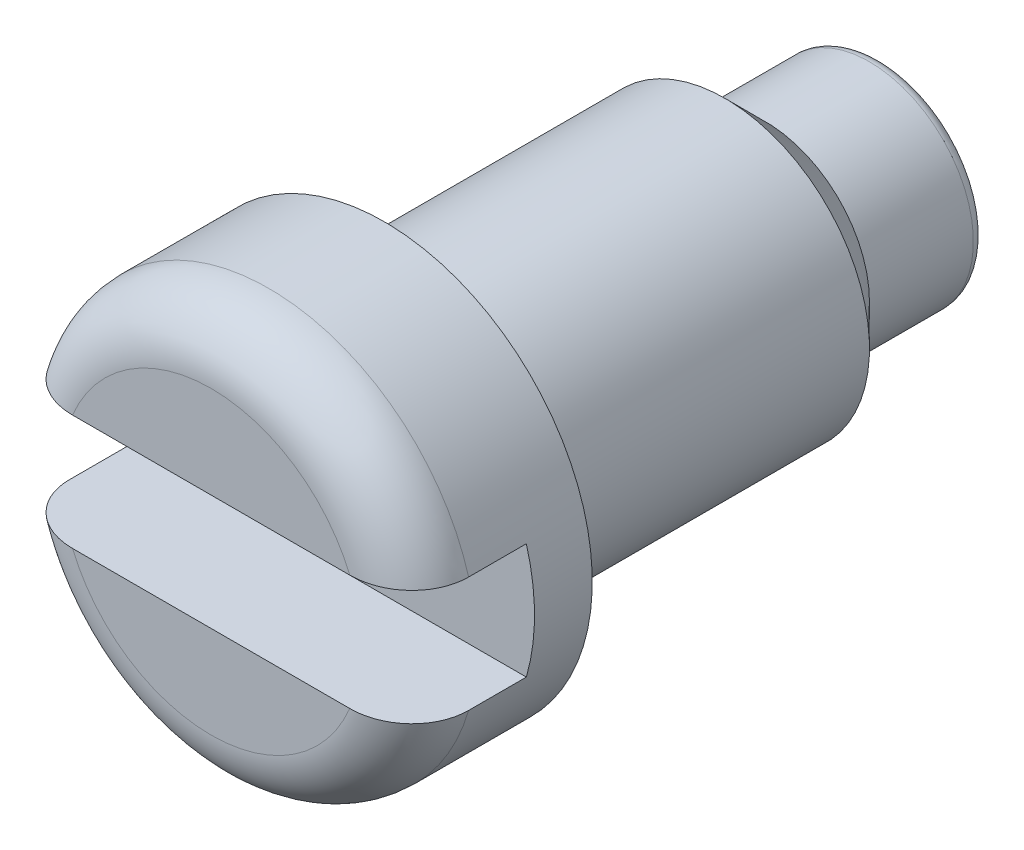
ISO-10303-21;
HEADER;
FILE_DESCRIPTION(('STEP AP214'),'2;1');
FILE_NAME('part.step','',(''),(''),'','','');
FILE_SCHEMA(('AUTOMOTIVE_DESIGN { 1 0 10303 214 1 1 1 1 }'));
ENDSEC;
DATA;
#1=APPLICATION_CONTEXT('core data for automotive mechanical design processes');
#2=APPLICATION_PROTOCOL_DEFINITION('international standard','automotive_design',2000,#1);
#3=PRODUCT_CONTEXT('',#1,'mechanical');
#4=PRODUCT('Part','Part','',(#3));
#5=PRODUCT_RELATED_PRODUCT_CATEGORY('part','',(#4));
#6=PRODUCT_DEFINITION_FORMATION('','',#4);
#7=PRODUCT_DEFINITION_CONTEXT('part definition',#1,'design');
#8=PRODUCT_DEFINITION('design','',#6,#7);
#9=PRODUCT_DEFINITION_SHAPE('','',#8);
#10=(LENGTH_UNIT() NAMED_UNIT(*) SI_UNIT(.MILLI.,.METRE.));
#11=(NAMED_UNIT(*) PLANE_ANGLE_UNIT() SI_UNIT($,.RADIAN.));
#12=(NAMED_UNIT(*) SI_UNIT($,.STERADIAN.) SOLID_ANGLE_UNIT());
#13=UNCERTAINTY_MEASURE_WITH_UNIT(LENGTH_MEASURE(1.E-05),#10,'distance_accuracy_value','');
#14=(GEOMETRIC_REPRESENTATION_CONTEXT(3) GLOBAL_UNCERTAINTY_ASSIGNED_CONTEXT((#13)) GLOBAL_UNIT_ASSIGNED_CONTEXT((#10,
#11,#12)) REPRESENTATION_CONTEXT('',''));
#15=CARTESIAN_POINT('',(0.,0.,0.));
#16=DIRECTION('',(0.,0.,1.));
#17=DIRECTION('',(1.,0.,0.));
#18=AXIS2_PLACEMENT_3D('',#15,#16,#17);
#19=CARTESIAN_POINT('',(1.8,0.5,4.80000000010954));
#20=DIRECTION('',(0.,0.,-1.));
#21=DIRECTION('',(-1.,0.,0.));
#22=AXIS2_PLACEMENT_3D('',#19,#20,#21);
#23=PLANE('',#22);
#24=CARTESIAN_POINT('',(0.,0.,4.80000000010954));
#25=DIRECTION('',(0.,0.,-1.));
#26=DIRECTION('',(-1.,0.,0.));
#27=AXIS2_PLACEMENT_3D('',#24,#25,#26);
#28=CIRCLE('',#27,1.8);
#29=CARTESIAN_POINT('',(-1.72916164657906,-0.5,4.80000000010954));
#30=VERTEX_POINT('',#29);
#31=CARTESIAN_POINT('',(-1.72916164657906,0.5,4.80000000010954));
#32=VERTEX_POINT('',#31);
#33=EDGE_CURVE('E81',#30,#32,#28,.T.);
#34=ORIENTED_EDGE('',*,*,#33,.F.);
#35=DIRECTION('',(1.,0.,0.));
#36=VECTOR('',#35,1.);
#37=CARTESIAN_POINT('',(1.8,-0.5,4.80000000010954));
#38=LINE('',#37,#36);
#39=CARTESIAN_POINT('',(1.72916164657906,-0.5,4.80000000010954));
#40=VERTEX_POINT('',#39);
#41=EDGE_CURVE('E79',#30,#40,#38,.T.);
#42=ORIENTED_EDGE('',*,*,#41,.T.);
#43=CARTESIAN_POINT('',(0.,0.,4.80000000010954));
#44=DIRECTION('',(0.,0.,-1.));
#45=DIRECTION('',(-1.,0.,0.));
#46=AXIS2_PLACEMENT_3D('',#43,#44,#45);
#47=CIRCLE('',#46,1.8);
#48=CARTESIAN_POINT('',(1.72916164657906,0.5,4.80000000010954));
#49=VERTEX_POINT('',#48);
#50=EDGE_CURVE('E19',#49,#40,#47,.T.);
#51=ORIENTED_EDGE('',*,*,#50,.F.);
#52=DIRECTION('',(1.,0.,0.));
#53=VECTOR('',#52,1.);
#54=CARTESIAN_POINT('',(1.8,0.5,4.80000000010954));
#55=LINE('',#54,#53);
#56=EDGE_CURVE('E73',#49,#32,#55,.F.);
#57=ORIENTED_EDGE('',*,*,#56,.T.);
#58=EDGE_LOOP('',(#34,#42,#51,#57));
#59=FACE_BOUND('',#58,.T.);
#60=ADVANCED_FACE('F16',(#59),#23,.F.);
#61=CARTESIAN_POINT('',(1.8,-0.5,4.80000000010954));
#62=DIRECTION('',(0.,-1.,0.));
#63=DIRECTION('',(0.,0.,-1.));
#64=AXIS2_PLACEMENT_3D('',#61,#62,#63);
#65=PLANE('',#64);
#66=ORIENTED_EDGE('',*,*,#41,.F.);
#67=DIRECTION('',(0.,0.,-1.));
#68=VECTOR('',#67,1.);
#69=CARTESIAN_POINT('',(-1.72916164657906,-0.5,4.80000000010954));
#70=LINE('',#69,#68);
#71=CARTESIAN_POINT('',(-1.72916164657906,-0.499999999999969,5.3));
#72=VERTEX_POINT('',#71);
#73=EDGE_CURVE('E90',#72,#30,#70,.T.);
#74=ORIENTED_EDGE('',*,*,#73,.F.);
#75=CARTESIAN_POINT('',(-1.2,-0.5,5.8));
#76=CARTESIAN_POINT('',(-1.23135408829868,-0.5,5.80002710345072));
#77=CARTESIAN_POINT('',(-1.262735329758,-0.5,5.79748739065803));
#78=CARTESIAN_POINT('',(-1.32471310536006,-0.5,5.78726419104236));
#79=CARTESIAN_POINT('',(-1.35530782615232,-0.5,5.77956976201622));
#80=CARTESIAN_POINT('',(-1.41479910682039,-0.5,5.75900375563596));
#81=CARTESIAN_POINT('',(-1.44369169282147,-0.5,5.74612057389816));
#82=CARTESIAN_POINT('',(-1.49869599333486,-0.5,5.7154279570273));
#83=CARTESIAN_POINT('',(-1.52481114016602,-0.5,5.69762470235656));
#84=CARTESIAN_POINT('',(-1.57204253600575,-0.5,5.65860759150654));
#85=CARTESIAN_POINT('',(-1.59335140376213,-0.5,5.63762698104221));
#86=CARTESIAN_POINT('',(-1.63190091435964,-0.5,5.59221640778683));
#87=CARTESIAN_POINT('',(-1.6491435400898,-0.5,5.56778813556497));
#88=CARTESIAN_POINT('',(-1.67815748822108,-0.5,5.51755560156855));
#89=CARTESIAN_POINT('',(-1.69016543317083,-0.500000000000001,5.49188760738414));
#90=CARTESIAN_POINT('',(-1.70952898266013,-0.499999999999999,5.43886966708624));
#91=CARTESIAN_POINT('',(-1.71689057252069,-0.499999999999996,5.4115219348364));
#92=CARTESIAN_POINT('',(-1.72425254933679,-0.500000000000002,5.36993630165131));
#93=CARTESIAN_POINT('',(-1.72609312352058,-0.500000000000006,5.3560015898568));
#94=CARTESIAN_POINT('',(-1.72854672842633,-0.499999999999994,5.328046918985));
#95=CARTESIAN_POINT('',(-1.72916171245651,-0.499999999999977,5.31402713133362));
#96=CARTESIAN_POINT('',(-1.72916164657907,-0.499999999999939,5.3));
#97=B_SPLINE_CURVE_WITH_KNOTS('',3,(#75,#76,#77,#78,#79,#80,#81,#82,#83,#84,#85,#86,#87,#88,#89,
#90,#91,#92,#93,#94,#95,#96),.UNSPECIFIED.,.F.,.F.,(4,2,2,2,2,2,2,2,2,2,4),(0.,
0.0940005177864056,0.188201210652693,0.282613758963356,0.376908243690361,0.46616114619862,
0.555370434415483,0.639971379387355,0.724463119862832,0.766583707832358,0.808637111434644),.UNSPECIFIED.);
#98=CARTESIAN_POINT('',(-1.2,-0.5,5.8));
#99=VERTEX_POINT('',#98);
#100=EDGE_CURVE('E364',#99,#72,#97,.T.);
#101=ORIENTED_EDGE('',*,*,#100,.F.);
#102=DIRECTION('',(1.,0.,0.));
#103=VECTOR('',#102,1.);
#104=CARTESIAN_POINT('',(0.,-0.50000000901788,5.8));
#105=LINE('',#104,#103);
#106=CARTESIAN_POINT('',(1.19999999624255,-0.500000007214304,5.8));
#107=VERTEX_POINT('',#106);
#108=EDGE_CURVE('E86',#107,#99,#105,.F.);
#109=ORIENTED_EDGE('',*,*,#108,.F.);
#110=CARTESIAN_POINT('',(1.72916164657906,-0.5,5.3));
#111=CARTESIAN_POINT('',(1.72918877175248,-0.5,5.32725888189283));
#112=CARTESIAN_POINT('',(1.72684299654031,-0.5,5.35450590677512));
#113=CARTESIAN_POINT('',(1.71761133525473,-0.5,5.40817398264718));
#114=CARTESIAN_POINT('',(1.71073314303607,-0.5,5.43459635403071));
#115=CARTESIAN_POINT('',(1.69263933674765,-0.5,5.48591522585722));
#116=CARTESIAN_POINT('',(1.68142288799435,-0.5,5.51081143159634));
#117=CARTESIAN_POINT('',(1.65502444081121,-0.5,5.55840170670631));
#118=CARTESIAN_POINT('',(1.63984211439434,-0.5,5.58109559372744));
#119=CARTESIAN_POINT('',(1.60575800816395,-0.5,5.62398729664331));
#120=CARTESIAN_POINT('',(1.58680934692357,-0.5,5.64414780853967));
#121=CARTESIAN_POINT('',(1.54590006631786,-0.5,5.68114106727313));
#122=CARTESIAN_POINT('',(1.52393849590542,-0.5,5.69797275923113));
#123=CARTESIAN_POINT('',(1.47678478866815,-0.5,5.72850935845452));
#124=CARTESIAN_POINT('',(1.45150347041406,-0.5,5.74207630356001));
#125=CARTESIAN_POINT('',(1.39909778035604,-0.5,5.76502377670576));
#126=CARTESIAN_POINT('',(1.37197253139944,-0.5,5.77440229603794));
#127=CARTESIAN_POINT('',(1.32074926795417,-0.5,5.78778687307017));
#128=CARTESIAN_POINT('',(1.29680292666121,-0.5,5.79238548167407));
#129=CARTESIAN_POINT('',(1.24856868576211,-0.5,5.79849267466426));
#130=CARTESIAN_POINT('',(1.2242816043004,-0.5,5.80000769494147));
#131=CARTESIAN_POINT('',(1.19999999624255,-0.5,5.8));
#132=B_SPLINE_CURVE_WITH_KNOTS('',3,(#110,#111,#112,#113,#114,#115,#116,#117,#118,#119,#120,
#121,#122,#123,#124,#125,#126,#127,#128,#129,#130,#131),.UNSPECIFIED.,.F.,.F.,(4,2,2,2,2,2,2,2,
2,2,4),(0.,0.0816579889276872,0.163177717890153,0.244713139112973,0.326255305635082,
0.408884400797901,0.491539638717868,0.577238526715486,0.662978470633408,0.735934290796779,
0.808737684910053),.UNSPECIFIED.);
#133=CARTESIAN_POINT('',(1.72916164657906,-0.5,5.3));
#134=VERTEX_POINT('',#133);
#135=EDGE_CURVE('E362',#134,#107,#132,.T.);
#136=ORIENTED_EDGE('',*,*,#135,.F.);
#137=DIRECTION('',(0.,0.,-1.));
#138=VECTOR('',#137,1.);
#139=CARTESIAN_POINT('',(1.72916164657906,-0.5,4.80000000010954));
#140=LINE('',#139,#138);
#141=EDGE_CURVE('E93',#40,#134,#140,.F.);
#142=ORIENTED_EDGE('',*,*,#141,.F.);
#143=EDGE_LOOP('',(#66,#74,#101,#109,#136,#142));
#144=FACE_BOUND('',#143,.T.);
#145=ADVANCED_FACE('F328',(#144),#65,.F.);
#146=CARTESIAN_POINT('',(1.8,0.5,5.80000000010954));
#147=DIRECTION('',(0.,1.,0.));
#148=DIRECTION('',(0.,0.,1.));
#149=AXIS2_PLACEMENT_3D('',#146,#147,#148);
#150=PLANE('',#149);
#151=ORIENTED_EDGE('',*,*,#56,.F.);
#152=DIRECTION('',(0.,0.,1.));
#153=VECTOR('',#152,1.);
#154=CARTESIAN_POINT('',(1.72916164657906,0.5,5.80000000010954));
#155=LINE('',#154,#153);
#156=CARTESIAN_POINT('',(1.72916164657906,0.499999999999969,5.3));
#157=VERTEX_POINT('',#156);
#158=EDGE_CURVE('E66',#157,#49,#155,.F.);
#159=ORIENTED_EDGE('',*,*,#158,.F.);
#160=CARTESIAN_POINT('',(1.2,0.5,5.8));
#161=CARTESIAN_POINT('',(1.23135408829868,0.5,5.80002710345072));
#162=CARTESIAN_POINT('',(1.262735329758,0.5,5.79748739065803));
#163=CARTESIAN_POINT('',(1.32471310536006,0.5,5.78726419104236));
#164=CARTESIAN_POINT('',(1.35530782615232,0.5,5.77956976201622));
#165=CARTESIAN_POINT('',(1.41479910682039,0.5,5.75900375563596));
#166=CARTESIAN_POINT('',(1.44369169282147,0.5,5.74612057389816));
#167=CARTESIAN_POINT('',(1.49869599333486,0.5,5.7154279570273));
#168=CARTESIAN_POINT('',(1.52481114016602,0.5,5.69762470235656));
#169=CARTESIAN_POINT('',(1.57204253600575,0.5,5.65860759150654));
#170=CARTESIAN_POINT('',(1.59335140376213,0.5,5.63762698104221));
#171=CARTESIAN_POINT('',(1.63190091435964,0.5,5.59221640778683));
#172=CARTESIAN_POINT('',(1.6491435400898,0.5,5.56778813556497));
#173=CARTESIAN_POINT('',(1.67815748822108,0.5,5.51755560156855));
#174=CARTESIAN_POINT('',(1.69016543317083,0.500000000000001,5.49188760738414));
#175=CARTESIAN_POINT('',(1.70952898266013,0.499999999999999,5.43886966708624));
#176=CARTESIAN_POINT('',(1.71689057252069,0.499999999999996,5.4115219348364));
#177=CARTESIAN_POINT('',(1.72425254933679,0.500000000000002,5.36993630165131));
#178=CARTESIAN_POINT('',(1.72609312352058,0.500000000000006,5.3560015898568));
#179=CARTESIAN_POINT('',(1.72854672842633,0.499999999999994,5.328046918985));
#180=CARTESIAN_POINT('',(1.72916171245651,0.499999999999977,5.31402713133362));
#181=CARTESIAN_POINT('',(1.72916164657906,0.499999999999938,5.3));
#182=B_SPLINE_CURVE_WITH_KNOTS('',3,(#160,#161,#162,#163,#164,#165,#166,#167,#168,#169,#170,
#171,#172,#173,#174,#175,#176,#177,#178,#179,#180,#181),.UNSPECIFIED.,.F.,.F.,(4,2,2,2,2,2,2,2,
2,2,4),(0.,0.0940005177864056,0.188201210652693,0.282613758963356,0.376908243690361,
0.46616114619862,0.555370434415483,0.639971379387355,0.724463119862832,0.766583707832358,
0.808637111434643),.UNSPECIFIED.);
#183=CARTESIAN_POINT('',(1.2,0.5,5.80000000000365));
#184=VERTEX_POINT('',#183);
#185=EDGE_CURVE('E34',#184,#157,#182,.T.);
#186=ORIENTED_EDGE('',*,*,#185,.F.);
#187=DIRECTION('',(1.,0.,0.));
#188=VECTOR('',#187,1.);
#189=CARTESIAN_POINT('',(0.,0.5,5.8));
#190=LINE('',#189,#188);
#191=CARTESIAN_POINT('',(-1.2,0.5,5.80000000000365));
#192=VERTEX_POINT('',#191);
#193=EDGE_CURVE('E169',#192,#184,#190,.T.);
#194=ORIENTED_EDGE('',*,*,#193,.F.);
#195=CARTESIAN_POINT('',(-1.72916164657906,0.5,5.3));
#196=CARTESIAN_POINT('',(-1.72918877175248,0.5,5.32725888189279));
#197=CARTESIAN_POINT('',(-1.72684299654032,0.5,5.35450590677504));
#198=CARTESIAN_POINT('',(-1.71761133525475,0.5,5.4081739826471));
#199=CARTESIAN_POINT('',(-1.71073314303609,0.5,5.43459635403067));
#200=CARTESIAN_POINT('',(-1.69263933674764,0.5,5.48591522585727));
#201=CARTESIAN_POINT('',(-1.68142288799431,0.5,5.51081143159644));
#202=CARTESIAN_POINT('',(-1.65502444081115,0.5,5.5584017067064));
#203=CARTESIAN_POINT('',(-1.63984211439431,0.5,5.58109559372749));
#204=CARTESIAN_POINT('',(-1.60575800816394,0.5,5.62398729664332));
#205=CARTESIAN_POINT('',(-1.58680934692357,0.5,5.64414780853968));
#206=CARTESIAN_POINT('',(-1.54590006631783,0.5,5.68114106727314));
#207=CARTESIAN_POINT('',(-1.52393849590538,0.5,5.69797275923114));
#208=CARTESIAN_POINT('',(-1.4767847886676,0.5,5.7285093584549));
#209=CARTESIAN_POINT('',(-1.45150347041297,0.5,5.74207630356066));
#210=CARTESIAN_POINT('',(-1.39909778035458,0.5,5.76502377670623));
#211=CARTESIAN_POINT('',(-1.37197253139825,0.5,5.77440229603813));
#212=CARTESIAN_POINT('',(-1.32074926855978,0.5,5.78778687291203));
#213=CARTESIAN_POINT('',(-1.29680292789355,0.5,5.79238548143768));
#214=CARTESIAN_POINT('',(-1.2485686882577,0.5,5.79849267442876));
#215=CARTESIAN_POINT('',(-1.22428160743253,0.5,5.80000769478495));
#216=CARTESIAN_POINT('',(-1.2,0.5,5.8));
#217=B_SPLINE_CURVE_WITH_KNOTS('',3,(#195,#196,#197,#198,#199,#200,#201,#202,#203,#204,#205,
#206,#207,#208,#209,#210,#211,#212,#213,#214,#215,#216),.UNSPECIFIED.,.F.,.F.,(4,2,2,2,2,2,2,2,
2,2,4),(0.,0.0816579889275671,0.163177717890153,0.24471313911313,0.326255305635082,
0.408884400797935,0.491539638717868,0.577238526717572,0.662978470633412,0.735934288921877,
0.808737681160134),.UNSPECIFIED.);
#218=CARTESIAN_POINT('',(-1.72916164657906,0.5,5.3));
#219=VERTEX_POINT('',#218);
#220=EDGE_CURVE('E102',#219,#192,#217,.T.);
#221=ORIENTED_EDGE('',*,*,#220,.F.);
#222=DIRECTION('',(0.,0.,1.));
#223=VECTOR('',#222,1.);
#224=CARTESIAN_POINT('',(-1.72916164657906,0.5,5.80000000010954));
#225=LINE('',#224,#223);
#226=EDGE_CURVE('E84',#32,#219,#225,.T.);
#227=ORIENTED_EDGE('',*,*,#226,.F.);
#228=EDGE_LOOP('',(#151,#159,#186,#194,#221,#227));
#229=FACE_BOUND('',#228,.T.);
#230=ADVANCED_FACE('F82',(#229),#150,.F.);
#231=CARTESIAN_POINT('',(0.,0.,5.8));
#232=DIRECTION('',(0.,0.,1.));
#233=DIRECTION('',(1.,0.,0.));
#234=AXIS2_PLACEMENT_3D('',#231,#232,#233);
#235=PLANE('',#234);
#236=ORIENTED_EDGE('',*,*,#108,.T.);
#237=CARTESIAN_POINT('',(0.,0.,5.8));
#238=DIRECTION('',(0.,0.,-1.));
#239=DIRECTION('',(0.923076920186577,-0.384615391552216,0.));
#240=AXIS2_PLACEMENT_3D('',#237,#238,#239);
#241=CIRCLE('',#240,1.3);
#242=EDGE_CURVE('E176',#107,#99,#241,.T.);
#243=ORIENTED_EDGE('',*,*,#242,.F.);
#244=EDGE_LOOP('',(#236,#243));
#245=FACE_BOUND('',#244,.T.);
#246=ADVANCED_FACE('F160',(#245),#235,.T.);
#247=CARTESIAN_POINT('',(0.,0.,5.8));
#248=DIRECTION('',(0.,0.,1.));
#249=DIRECTION('',(1.,0.,0.));
#250=AXIS2_PLACEMENT_3D('',#247,#248,#249);
#251=PLANE('',#250);
#252=ORIENTED_EDGE('',*,*,#193,.T.);
#253=CARTESIAN_POINT('',(0.,0.,5.8));
#254=DIRECTION('',(0.,0.,-1.));
#255=DIRECTION('',(-0.923076923076923,0.384615384615385,0.));
#256=AXIS2_PLACEMENT_3D('',#253,#254,#255);
#257=CIRCLE('',#256,1.3);
#258=EDGE_CURVE('E181',#192,#184,#257,.T.);
#259=ORIENTED_EDGE('',*,*,#258,.F.);
#260=EDGE_LOOP('',(#252,#259));
#261=FACE_BOUND('',#260,.T.);
#262=ADVANCED_FACE('F157',(#261),#251,.T.);
#263=CARTESIAN_POINT('',(0.,0.,0.));
#264=DIRECTION('',(0.,0.,-1.));
#265=DIRECTION('',(-1.,0.,0.));
#266=AXIS2_PLACEMENT_3D('',#263,#264,#265);
#267=PLANE('',#266);
#268=CARTESIAN_POINT('',(0.,0.,0.));
#269=DIRECTION('',(0.,0.,1.));
#270=DIRECTION('',(-1.,0.,0.));
#271=AXIS2_PLACEMENT_3D('',#268,#269,#270);
#272=CIRCLE('',#271,0.8);
#273=CARTESIAN_POINT('',(-0.8,0.,0.));
#274=VERTEX_POINT('',#273);
#275=EDGE_CURVE('E139',#274,#274,#272,.T.);
#276=ORIENTED_EDGE('',*,*,#275,.F.);
#277=EDGE_LOOP('',(#276));
#278=FACE_BOUND('',#277,.T.);
#279=ADVANCED_FACE('F148',(#278),#267,.T.);
#280=CARTESIAN_POINT('',(0.,0.,5.3));
#281=DIRECTION('',(0.,0.,-1.));
#282=DIRECTION('',(-1.,0.,0.));
#283=AXIS2_PLACEMENT_3D('',#280,#281,#282);
#284=TOROIDAL_SURFACE('',#283,1.3,0.5);
#285=ORIENTED_EDGE('',*,*,#100,.T.);
#286=CARTESIAN_POINT('',(0.,0.,5.3));
#287=DIRECTION('',(0.,0.,-1.));
#288=DIRECTION('',(-1.,0.,0.));
#289=AXIS2_PLACEMENT_3D('',#286,#287,#288);
#290=CIRCLE('',#289,1.8);
#291=EDGE_CURVE('E134',#134,#72,#290,.T.);
#292=ORIENTED_EDGE('',*,*,#291,.F.);
#293=ORIENTED_EDGE('',*,*,#135,.T.);
#294=ORIENTED_EDGE('',*,*,#242,.T.);
#295=EDGE_LOOP('',(#285,#292,#293,#294));
#296=FACE_BOUND('',#295,.T.);
#297=ADVANCED_FACE('F120',(#296),#284,.T.);
#298=CARTESIAN_POINT('',(0.,0.,5.3));
#299=DIRECTION('',(0.,0.,-1.));
#300=DIRECTION('',(-1.,0.,0.));
#301=AXIS2_PLACEMENT_3D('',#298,#299,#300);
#302=TOROIDAL_SURFACE('',#301,1.3,0.5);
#303=ORIENTED_EDGE('',*,*,#185,.T.);
#304=CARTESIAN_POINT('',(0.,0.,5.3));
#305=DIRECTION('',(0.,0.,-1.));
#306=DIRECTION('',(-1.,0.,0.));
#307=AXIS2_PLACEMENT_3D('',#304,#305,#306);
#308=CIRCLE('',#307,1.8);
#309=EDGE_CURVE('E71',#219,#157,#308,.T.);
#310=ORIENTED_EDGE('',*,*,#309,.F.);
#311=ORIENTED_EDGE('',*,*,#220,.T.);
#312=ORIENTED_EDGE('',*,*,#258,.T.);
#313=EDGE_LOOP('',(#303,#310,#311,#312));
#314=FACE_BOUND('',#313,.T.);
#315=ADVANCED_FACE('F113',(#314),#302,.T.);
#316=CARTESIAN_POINT('',(0.,0.,0.1));
#317=DIRECTION('',(0.,0.,-1.));
#318=DIRECTION('',(-1.,0.,0.));
#319=AXIS2_PLACEMENT_3D('',#316,#317,#318);
#320=TOROIDAL_SURFACE('',#319,0.8,0.1);
#321=CARTESIAN_POINT('',(0.,0.,0.1));
#322=DIRECTION('',(0.,0.,-1.));
#323=DIRECTION('',(-1.,0.,0.));
#324=AXIS2_PLACEMENT_3D('',#321,#322,#323);
#325=CIRCLE('',#324,0.9);
#326=CARTESIAN_POINT('',(-0.9,0.,0.1));
#327=VERTEX_POINT('',#326);
#328=EDGE_CURVE('E100',#327,#327,#325,.F.);
#329=ORIENTED_EDGE('',*,*,#328,.F.);
#330=EDGE_LOOP('',(#329));
#331=FACE_BOUND('',#330,.T.);
#332=ORIENTED_EDGE('',*,*,#275,.T.);
#333=EDGE_LOOP('',(#332));
#334=FACE_BOUND('',#333,.T.);
#335=ADVANCED_FACE('F119',(#331,#334),#320,.T.);
#336=CARTESIAN_POINT('',(0.,0.,5.3));
#337=DIRECTION('',(0.,0.,-1.));
#338=DIRECTION('',(-1.,0.,0.));
#339=AXIS2_PLACEMENT_3D('',#336,#337,#338);
#340=CYLINDRICAL_SURFACE('',#339,1.8);
#341=CARTESIAN_POINT('',(0.,0.,4.3));
#342=DIRECTION('',(0.,0.,-1.));
#343=DIRECTION('',(-1.,0.,0.));
#344=AXIS2_PLACEMENT_3D('',#341,#342,#343);
#345=CIRCLE('',#344,1.8);
#346=CARTESIAN_POINT('',(-1.8,0.,4.3));
#347=VERTEX_POINT('',#346);
#348=EDGE_CURVE('E97',#347,#347,#345,.T.);
#349=ORIENTED_EDGE('',*,*,#348,.F.);
#350=EDGE_LOOP('',(#349));
#351=FACE_BOUND('',#350,.T.);
#352=ORIENTED_EDGE('',*,*,#226,.T.);
#353=ORIENTED_EDGE('',*,*,#309,.T.);
#354=ORIENTED_EDGE('',*,*,#158,.T.);
#355=ORIENTED_EDGE('',*,*,#50,.T.);
#356=ORIENTED_EDGE('',*,*,#141,.T.);
#357=ORIENTED_EDGE('',*,*,#291,.T.);
#358=ORIENTED_EDGE('',*,*,#73,.T.);
#359=ORIENTED_EDGE('',*,*,#33,.T.);
#360=EDGE_LOOP('',(#352,#353,#354,#355,#356,#357,#358,#359));
#361=FACE_BOUND('',#360,.T.);
#362=ADVANCED_FACE('F68',(#351,#361),#340,.T.);
#363=CARTESIAN_POINT('',(0.,0.,1.));
#364=DIRECTION('',(0.,0.,-1.));
#365=DIRECTION('',(-1.,0.,0.));
#366=AXIS2_PLACEMENT_3D('',#363,#364,#365);
#367=CYLINDRICAL_SURFACE('',#366,0.9);
#368=ORIENTED_EDGE('',*,*,#328,.T.);
#369=EDGE_LOOP('',(#368));
#370=FACE_BOUND('',#369,.T.);
#371=CARTESIAN_POINT('',(0.,0.,0.999999999976353));
#372=DIRECTION('',(0.,0.,1.));
#373=DIRECTION('',(1.,0.,0.));
#374=AXIS2_PLACEMENT_3D('',#371,#372,#373);
#375=CIRCLE('',#374,0.900000000001455);
#376=CARTESIAN_POINT('',(0.900000000001455,0.,0.999999999976353));
#377=VERTEX_POINT('',#376);
#378=EDGE_CURVE('E96',#377,#377,#375,.T.);
#379=ORIENTED_EDGE('',*,*,#378,.F.);
#380=EDGE_LOOP('',(#379));
#381=FACE_BOUND('',#380,.T.);
#382=ADVANCED_FACE('F223',(#370,#381),#367,.T.);
#383=CARTESIAN_POINT('',(0.,0.,4.3));
#384=DIRECTION('',(0.,0.,-1.));
#385=DIRECTION('',(-1.,0.,0.));
#386=AXIS2_PLACEMENT_3D('',#383,#384,#385);
#387=PLANE('',#386);
#388=CARTESIAN_POINT('',(0.,0.,4.3));
#389=DIRECTION('',(0.,0.,-1.));
#390=DIRECTION('',(-1.,0.,0.));
#391=AXIS2_PLACEMENT_3D('',#388,#389,#390);
#392=CIRCLE('',#391,1.25);
#393=CARTESIAN_POINT('',(-1.25,0.,4.3));
#394=VERTEX_POINT('',#393);
#395=EDGE_CURVE('E25',#394,#394,#392,.T.);
#396=ORIENTED_EDGE('',*,*,#395,.F.);
#397=EDGE_LOOP('',(#396));
#398=FACE_BOUND('',#397,.T.);
#399=ORIENTED_EDGE('',*,*,#348,.T.);
#400=EDGE_LOOP('',(#399));
#401=FACE_BOUND('',#400,.T.);
#402=ADVANCED_FACE('F234',(#398,#401),#387,.T.);
#403=CARTESIAN_POINT('',(0.,0.,1.35000000000218));
#404=DIRECTION('',(0.,0.,1.));
#405=DIRECTION('',(1.,0.,0.));
#406=AXIS2_PLACEMENT_3D('',#403,#404,#405);
#407=CONICAL_SURFACE('',#406,1.25000000002728,0.785398163397448);
#408=CARTESIAN_POINT('',(0.,0.,1.35));
#409=DIRECTION('',(0.,0.,-1.));
#410=DIRECTION('',(-1.,0.,0.));
#411=AXIS2_PLACEMENT_3D('',#408,#409,#410);
#412=CIRCLE('',#411,1.25);
#413=CARTESIAN_POINT('',(-1.25,0.,1.35));
#414=VERTEX_POINT('',#413);
#415=EDGE_CURVE('E11',#414,#414,#412,.F.);
#416=ORIENTED_EDGE('',*,*,#415,.F.);
#417=EDGE_LOOP('',(#416));
#418=FACE_BOUND('',#417,.T.);
#419=ORIENTED_EDGE('',*,*,#378,.T.);
#420=EDGE_LOOP('',(#419));
#421=FACE_BOUND('',#420,.T.);
#422=ADVANCED_FACE('F228',(#418,#421),#407,.T.);
#423=CARTESIAN_POINT('',(0.,0.,4.3));
#424=DIRECTION('',(0.,0.,-1.));
#425=DIRECTION('',(-1.,0.,0.));
#426=AXIS2_PLACEMENT_3D('',#423,#424,#425);
#427=CYLINDRICAL_SURFACE('',#426,1.25);
#428=ORIENTED_EDGE('',*,*,#415,.T.);
#429=EDGE_LOOP('',(#428));
#430=FACE_BOUND('',#429,.T.);
#431=ORIENTED_EDGE('',*,*,#395,.T.);
#432=EDGE_LOOP('',(#431));
#433=FACE_BOUND('',#432,.T.);
#434=ADVANCED_FACE('F226',(#430,#433),#427,.T.);
#435=CLOSED_SHELL('',(#60,#145,#230,#246,#262,#279,#297,#315,#335,#362,#382,#402,#422,#434));
#436=MANIFOLD_SOLID_BREP('B1',#435);
#437=ADVANCED_BREP_SHAPE_REPRESENTATION('',(#18,#436),#14);
#438=SHAPE_DEFINITION_REPRESENTATION(#9,#437);
ENDSEC;
END-ISO-10303-21;
